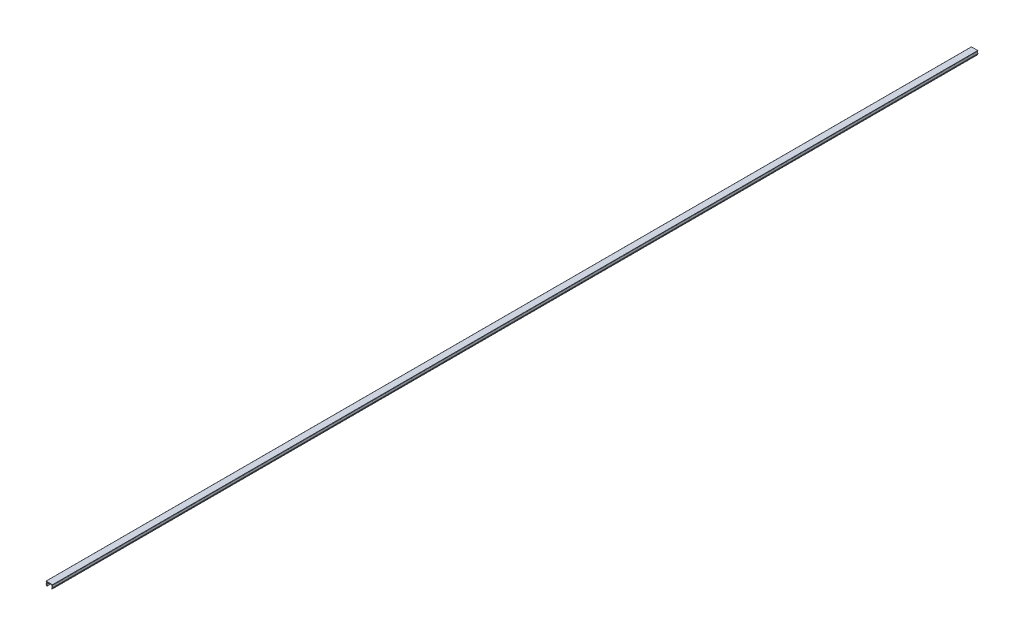
ISO-10303-21;
HEADER;
FILE_DESCRIPTION(('STEP AP214'),'2;1');
FILE_NAME('part.step','',(''),(''),'','','');
FILE_SCHEMA(('AUTOMOTIVE_DESIGN { 1 0 10303 214 1 1 1 1 }'));
ENDSEC;
DATA;
#1=APPLICATION_CONTEXT('core data for automotive mechanical design processes');
#2=APPLICATION_PROTOCOL_DEFINITION('international standard','automotive_design',2000,#1);
#3=PRODUCT_CONTEXT('',#1,'mechanical');
#4=PRODUCT('Part','Part','',(#3));
#5=PRODUCT_RELATED_PRODUCT_CATEGORY('part','',(#4));
#6=PRODUCT_DEFINITION_FORMATION('','',#4);
#7=PRODUCT_DEFINITION_CONTEXT('part definition',#1,'design');
#8=PRODUCT_DEFINITION('design','',#6,#7);
#9=PRODUCT_DEFINITION_SHAPE('','',#8);
#10=(LENGTH_UNIT() NAMED_UNIT(*) SI_UNIT(.MILLI.,.METRE.));
#11=(NAMED_UNIT(*) PLANE_ANGLE_UNIT() SI_UNIT($,.RADIAN.));
#12=(NAMED_UNIT(*) SI_UNIT($,.STERADIAN.) SOLID_ANGLE_UNIT());
#13=UNCERTAINTY_MEASURE_WITH_UNIT(LENGTH_MEASURE(1.E-05),#10,'distance_accuracy_value','');
#14=(GEOMETRIC_REPRESENTATION_CONTEXT(3) GLOBAL_UNCERTAINTY_ASSIGNED_CONTEXT((#13)) GLOBAL_UNIT_ASSIGNED_CONTEXT((#10,
#11,#12)) REPRESENTATION_CONTEXT('',''));
#15=CARTESIAN_POINT('',(0.,0.,0.));
#16=DIRECTION('',(0.,0.,1.));
#17=DIRECTION('',(1.,0.,0.));
#18=AXIS2_PLACEMENT_3D('',#15,#16,#17);
#19=CARTESIAN_POINT('',(3.7477937494903,87.1633342061206,1000.));
#20=DIRECTION('',(0.,0.,-1.));
#21=DIRECTION('',(-1.,0.,0.));
#22=AXIS2_PLACEMENT_3D('',#19,#20,#21);
#23=CYLINDRICAL_SURFACE('',#22,0.5);
#24=CARTESIAN_POINT('',(3.7477937494903,87.1633342061206,0.));
#25=DIRECTION('',(0.,0.,1.));
#26=DIRECTION('',(1.,0.,0.));
#27=AXIS2_PLACEMENT_3D('',#24,#25,#26);
#28=CIRCLE('',#27,0.5);
#29=CARTESIAN_POINT('',(3.25538987298423,87.2501582949543,0.));
#30=VERTEX_POINT('',#29);
#31=CARTESIAN_POINT('',(3.27794743909727,86.992324134458,0.));
#32=VERTEX_POINT('',#31);
#33=EDGE_CURVE('E223',#30,#32,#28,.T.);
#34=ORIENTED_EDGE('',*,*,#33,.T.);
#35=DIRECTION('',(0.,0.,-1.));
#36=VECTOR('',#35,1.);
#37=CARTESIAN_POINT('',(3.27794743909727,86.992324134458,1000.));
#38=LINE('',#37,#36);
#39=CARTESIAN_POINT('',(3.27794743909727,86.992324134458,1000.));
#40=VERTEX_POINT('',#39);
#41=EDGE_CURVE('E11',#40,#32,#38,.T.);
#42=ORIENTED_EDGE('',*,*,#41,.F.);
#43=CARTESIAN_POINT('',(3.7477937494903,87.1633342061206,1000.));
#44=DIRECTION('',(0.,0.,1.));
#45=DIRECTION('',(1.,0.,0.));
#46=AXIS2_PLACEMENT_3D('',#43,#44,#45);
#47=CIRCLE('',#46,0.5);
#48=CARTESIAN_POINT('',(3.25538987298423,87.2501582949543,1000.));
#49=VERTEX_POINT('',#48);
#50=EDGE_CURVE('E269',#49,#40,#47,.T.);
#51=ORIENTED_EDGE('',*,*,#50,.F.);
#52=DIRECTION('',(0.,0.,-1.));
#53=VECTOR('',#52,1.);
#54=CARTESIAN_POINT('',(3.25538987298423,87.2501582949543,1000.));
#55=LINE('',#54,#53);
#56=EDGE_CURVE('E219',#49,#30,#55,.T.);
#57=ORIENTED_EDGE('',*,*,#56,.T.);
#58=EDGE_LOOP('',(#34,#42,#51,#57));
#59=FACE_BOUND('',#58,.T.);
#60=ADVANCED_FACE('F31',(#59),#23,.T.);
#61=CARTESIAN_POINT('',(3.71984554241389,85.7782190738955,1000.));
#62=DIRECTION('',(0.93969262078593,0.342020143325608,0.));
#63=DIRECTION('',(-0.342020143325608,0.93969262078593,0.));
#64=AXIS2_PLACEMENT_3D('',#61,#62,#63);
#65=PLANE('',#64);
#66=DIRECTION('',(0.342020143325608,-0.93969262078593,0.));
#67=VECTOR('',#66,1.);
#68=CARTESIAN_POINT('',(3.71984554241389,85.7782190738955,0.));
#69=LINE('',#68,#67);
#70=CARTESIAN_POINT('',(3.71984554241474,85.7782190738958,0.));
#71=VERTEX_POINT('',#70);
#72=EDGE_CURVE('E226',#32,#71,#69,.T.);
#73=ORIENTED_EDGE('',*,*,#72,.T.);
#74=DIRECTION('',(0.,0.,-1.));
#75=VECTOR('',#74,1.);
#76=CARTESIAN_POINT('',(3.71984554241474,85.7782190738958,1000.));
#77=LINE('',#76,#75);
#78=CARTESIAN_POINT('',(3.71984554241474,85.7782190738958,1000.));
#79=VERTEX_POINT('',#78);
#80=EDGE_CURVE('E39',#79,#71,#77,.T.);
#81=ORIENTED_EDGE('',*,*,#80,.F.);
#82=DIRECTION('',(0.342020143325608,-0.93969262078593,0.));
#83=VECTOR('',#82,1.);
#84=CARTESIAN_POINT('',(3.71984554241389,85.7782190738955,1000.));
#85=LINE('',#84,#83);
#86=EDGE_CURVE('E138',#40,#79,#85,.T.);
#87=ORIENTED_EDGE('',*,*,#86,.F.);
#88=ORIENTED_EDGE('',*,*,#41,.T.);
#89=EDGE_LOOP('',(#73,#81,#87,#88));
#90=FACE_BOUND('',#89,.T.);
#91=ADVANCED_FACE('F407',(#90),#65,.F.);
#92=CARTESIAN_POINT('',(3.94400660807878,85.8598070294793,1000.));
#93=DIRECTION('',(0.,0.,-1.));
#94=DIRECTION('',(-1.,0.,0.));
#95=AXIS2_PLACEMENT_3D('',#92,#93,#94);
#96=CYLINDRICAL_SURFACE('',#95,0.238547223534299);
#97=CARTESIAN_POINT('',(3.94400660807878,85.8598070294793,0.));
#98=DIRECTION('',(0.,0.,1.));
#99=DIRECTION('',(1.,0.,0.));
#100=AXIS2_PLACEMENT_3D('',#97,#98,#99);
#101=CIRCLE('',#100,0.238547223534299);
#102=CARTESIAN_POINT('',(4.16816767374212,85.941394985062,0.));
#103=VERTEX_POINT('',#102);
#104=EDGE_CURVE('E228',#71,#103,#101,.T.);
#105=ORIENTED_EDGE('',*,*,#104,.T.);
#106=DIRECTION('',(0.,0.,-1.));
#107=VECTOR('',#106,1.);
#108=CARTESIAN_POINT('',(4.16816767374212,85.941394985062,1000.));
#109=LINE('',#108,#107);
#110=CARTESIAN_POINT('',(4.16816767374212,85.941394985062,1000.));
#111=VERTEX_POINT('',#110);
#112=EDGE_CURVE('E324',#111,#103,#109,.T.);
#113=ORIENTED_EDGE('',*,*,#112,.F.);
#114=CARTESIAN_POINT('',(3.94400660807878,85.8598070294793,1000.));
#115=DIRECTION('',(0.,0.,1.));
#116=DIRECTION('',(1.,0.,0.));
#117=AXIS2_PLACEMENT_3D('',#114,#115,#116);
#118=CIRCLE('',#117,0.238547223534299);
#119=EDGE_CURVE('E332',#79,#111,#118,.T.);
#120=ORIENTED_EDGE('',*,*,#119,.F.);
#121=ORIENTED_EDGE('',*,*,#80,.T.);
#122=EDGE_LOOP('',(#105,#113,#120,#121));
#123=FACE_BOUND('',#122,.T.);
#124=ADVANCED_FACE('F330',(#123),#96,.T.);
#125=CARTESIAN_POINT('',(3.74900313655878,87.0930400860075,1000.));
#126=DIRECTION('',(-0.939692620785726,-0.342020143326169,0.));
#127=DIRECTION('',(0.342020143326169,-0.939692620785726,0.));
#128=AXIS2_PLACEMENT_3D('',#125,#126,#127);
#129=PLANE('',#128);
#130=DIRECTION('',(-0.342020143326169,0.939692620785726,0.));
#131=VECTOR('',#130,1.);
#132=CARTESIAN_POINT('',(3.74900313655878,87.0930400860075,0.));
#133=LINE('',#132,#131);
#134=CARTESIAN_POINT('',(3.74900313655878,87.0930400860075,0.));
#135=VERTEX_POINT('',#134);
#136=EDGE_CURVE('E230',#103,#135,#133,.T.);
#137=ORIENTED_EDGE('',*,*,#136,.T.);
#138=DIRECTION('',(0.,0.,-1.));
#139=VECTOR('',#138,1.);
#140=CARTESIAN_POINT('',(3.74900313655878,87.0930400860075,1000.));
#141=LINE('',#140,#139);
#142=CARTESIAN_POINT('',(3.74900313655878,87.0930400860075,1000.));
#143=VERTEX_POINT('',#142);
#144=EDGE_CURVE('E321',#143,#135,#141,.T.);
#145=ORIENTED_EDGE('',*,*,#144,.F.);
#146=DIRECTION('',(-0.342020143326169,0.939692620785726,0.));
#147=VECTOR('',#146,1.);
#148=CARTESIAN_POINT('',(3.74900313655878,87.0930400860075,1000.));
#149=LINE('',#148,#147);
#150=EDGE_CURVE('E350',#111,#143,#149,.T.);
#151=ORIENTED_EDGE('',*,*,#150,.F.);
#152=ORIENTED_EDGE('',*,*,#112,.T.);
#153=EDGE_LOOP('',(#137,#145,#151,#152));
#154=FACE_BOUND('',#153,.T.);
#155=ADVANCED_FACE('F341',(#154),#129,.F.);
#156=CARTESIAN_POINT('',(3.84297239863858,87.1272421003405,1000.));
#157=DIRECTION('',(0.,0.,-1.));
#158=DIRECTION('',(-1.,0.,0.));
#159=AXIS2_PLACEMENT_3D('',#156,#157,#158);
#160=CYLINDRICAL_SURFACE('',#159,0.100000000001303);
#161=CARTESIAN_POINT('',(3.84297239863858,87.1272421003405,0.));
#162=DIRECTION('',(0.,0.,-1.));
#163=DIRECTION('',(1.,0.,0.));
#164=AXIS2_PLACEMENT_3D('',#161,#162,#163);
#165=CIRCLE('',#164,0.100000000001303);
#166=CARTESIAN_POINT('',(3.74449162333608,87.1446069181075,0.));
#167=VERTEX_POINT('',#166);
#168=EDGE_CURVE('E232',#135,#167,#165,.T.);
#169=ORIENTED_EDGE('',*,*,#168,.T.);
#170=DIRECTION('',(0.,0.,-1.));
#171=VECTOR('',#170,1.);
#172=CARTESIAN_POINT('',(3.74449162333608,87.1446069181075,1000.));
#173=LINE('',#172,#171);
#174=CARTESIAN_POINT('',(3.74449162333608,87.1446069181075,1000.));
#175=VERTEX_POINT('',#174);
#176=EDGE_CURVE('E318',#175,#167,#173,.T.);
#177=ORIENTED_EDGE('',*,*,#176,.F.);
#178=CARTESIAN_POINT('',(3.84297239863858,87.1272421003405,1000.));
#179=DIRECTION('',(0.,0.,-1.));
#180=DIRECTION('',(1.,0.,0.));
#181=AXIS2_PLACEMENT_3D('',#178,#179,#180);
#182=CIRCLE('',#181,0.100000000001303);
#183=EDGE_CURVE('E347',#143,#175,#182,.T.);
#184=ORIENTED_EDGE('',*,*,#183,.F.);
#185=ORIENTED_EDGE('',*,*,#144,.T.);
#186=EDGE_LOOP('',(#169,#177,#184,#185));
#187=FACE_BOUND('',#186,.T.);
#188=ADVANCED_FACE('F345',(#187),#160,.F.);
#189=CARTESIAN_POINT('',(4.18065618621034,89.6182190738957,1000.));
#190=DIRECTION('',(-0.984807753012184,0.173648177667068,0.));
#191=DIRECTION('',(-0.173648177667068,-0.984807753012184,0.));
#192=AXIS2_PLACEMENT_3D('',#189,#190,#191);
#193=PLANE('',#192);
#194=DIRECTION('',(0.173648177667068,0.984807753012184,0.));
#195=VECTOR('',#194,1.);
#196=CARTESIAN_POINT('',(4.18065618621034,89.6182190738957,0.));
#197=LINE('',#196,#195);
#198=CARTESIAN_POINT('',(4.18065618621034,89.6182190738957,0.));
#199=VERTEX_POINT('',#198);
#200=EDGE_CURVE('E234',#167,#199,#197,.T.);
#201=ORIENTED_EDGE('',*,*,#200,.T.);
#202=DIRECTION('',(0.,0.,-1.));
#203=VECTOR('',#202,1.);
#204=CARTESIAN_POINT('',(4.18065618621034,89.6182190738957,1000.));
#205=LINE('',#204,#203);
#206=CARTESIAN_POINT('',(4.18065618621034,89.6182190738957,1000.));
#207=VERTEX_POINT('',#206);
#208=EDGE_CURVE('E315',#207,#199,#205,.T.);
#209=ORIENTED_EDGE('',*,*,#208,.F.);
#210=DIRECTION('',(0.173648177667068,0.984807753012184,0.));
#211=VECTOR('',#210,1.);
#212=CARTESIAN_POINT('',(4.18065618621034,89.6182190738957,1000.));
#213=LINE('',#212,#211);
#214=EDGE_CURVE('E349',#175,#207,#213,.T.);
#215=ORIENTED_EDGE('',*,*,#214,.F.);
#216=ORIENTED_EDGE('',*,*,#176,.T.);
#217=EDGE_LOOP('',(#201,#209,#215,#216));
#218=FACE_BOUND('',#217,.T.);
#219=ADVANCED_FACE('F420',(#218),#193,.F.);
#220=CARTESIAN_POINT('',(9.16522957432238,89.6182190738957,1000.));
#221=DIRECTION('',(0.,1.,0.));
#222=DIRECTION('',(0.,0.,1.));
#223=AXIS2_PLACEMENT_3D('',#220,#221,#222);
#224=PLANE('',#223);
#225=DIRECTION('',(1.,0.,0.));
#226=VECTOR('',#225,1.);
#227=CARTESIAN_POINT('',(9.16522957432238,89.6182190738957,0.));
#228=LINE('',#227,#226);
#229=CARTESIAN_POINT('',(9.16522957432238,89.6182190738957,0.));
#230=VERTEX_POINT('',#229);
#231=EDGE_CURVE('E236',#199,#230,#228,.T.);
#232=ORIENTED_EDGE('',*,*,#231,.T.);
#233=DIRECTION('',(0.,0.,-1.));
#234=VECTOR('',#233,1.);
#235=CARTESIAN_POINT('',(9.16522957432238,89.6182190738957,1000.));
#236=LINE('',#235,#234);
#237=CARTESIAN_POINT('',(9.16522957432238,89.6182190738957,1000.));
#238=VERTEX_POINT('',#237);
#239=EDGE_CURVE('E312',#238,#230,#236,.T.);
#240=ORIENTED_EDGE('',*,*,#239,.F.);
#241=DIRECTION('',(1.,0.,0.));
#242=VECTOR('',#241,1.);
#243=CARTESIAN_POINT('',(9.16522957432238,89.6182190738957,1000.));
#244=LINE('',#243,#242);
#245=EDGE_CURVE('E352',#207,#238,#244,.T.);
#246=ORIENTED_EDGE('',*,*,#245,.F.);
#247=ORIENTED_EDGE('',*,*,#208,.T.);
#248=EDGE_LOOP('',(#232,#240,#246,#247));
#249=FACE_BOUND('',#248,.T.);
#250=ADVANCED_FACE('F423',(#249),#224,.F.);
#251=CARTESIAN_POINT('',(9.60139413719656,87.1446069181068,1000.));
#252=DIRECTION('',(0.984807753012197,0.173648177666994,0.));
#253=DIRECTION('',(-0.173648177666994,0.984807753012197,0.));
#254=AXIS2_PLACEMENT_3D('',#251,#252,#253);
#255=PLANE('',#254);
#256=DIRECTION('',(0.173648177666994,-0.984807753012197,0.));
#257=VECTOR('',#256,1.);
#258=CARTESIAN_POINT('',(9.60139413719656,87.1446069181068,0.));
#259=LINE('',#258,#257);
#260=CARTESIAN_POINT('',(9.60139413719656,87.1446069181068,0.));
#261=VERTEX_POINT('',#260);
#262=EDGE_CURVE('E238',#230,#261,#259,.T.);
#263=ORIENTED_EDGE('',*,*,#262,.T.);
#264=DIRECTION('',(0.,0.,-1.));
#265=VECTOR('',#264,1.);
#266=CARTESIAN_POINT('',(9.60139413719656,87.1446069181068,1000.));
#267=LINE('',#266,#265);
#268=CARTESIAN_POINT('',(9.60139413719656,87.1446069181068,1000.));
#269=VERTEX_POINT('',#268);
#270=EDGE_CURVE('E309',#269,#261,#267,.T.);
#271=ORIENTED_EDGE('',*,*,#270,.F.);
#272=DIRECTION('',(0.173648177666994,-0.984807753012197,0.));
#273=VECTOR('',#272,1.);
#274=CARTESIAN_POINT('',(9.60139413719656,87.1446069181068,1000.));
#275=LINE('',#274,#273);
#276=EDGE_CURVE('E358',#238,#269,#275,.T.);
#277=ORIENTED_EDGE('',*,*,#276,.F.);
#278=ORIENTED_EDGE('',*,*,#239,.T.);
#279=EDGE_LOOP('',(#263,#271,#277,#278));
#280=FACE_BOUND('',#279,.T.);
#281=ADVANCED_FACE('F427',(#280),#255,.F.);
#282=CARTESIAN_POINT('',(9.50291336189533,87.1272421003407,1000.));
#283=DIRECTION('',(0.,0.,-1.));
#284=DIRECTION('',(-1.,0.,0.));
#285=AXIS2_PLACEMENT_3D('',#282,#283,#284);
#286=CYLINDRICAL_SURFACE('',#285,0.0999999999999064);
#287=CARTESIAN_POINT('',(9.50291336189533,87.1272421003407,0.));
#288=DIRECTION('',(0.,0.,-1.));
#289=DIRECTION('',(1.,0.,0.));
#290=AXIS2_PLACEMENT_3D('',#287,#288,#289);
#291=CIRCLE('',#290,0.0999999999999064);
#292=CARTESIAN_POINT('',(9.59688262397385,87.0930400860082,0.));
#293=VERTEX_POINT('',#292);
#294=EDGE_CURVE('E240',#261,#293,#291,.T.);
#295=ORIENTED_EDGE('',*,*,#294,.T.);
#296=DIRECTION('',(0.,0.,-1.));
#297=VECTOR('',#296,1.);
#298=CARTESIAN_POINT('',(9.59688262397385,87.0930400860082,1000.));
#299=LINE('',#298,#297);
#300=CARTESIAN_POINT('',(9.59688262397385,87.0930400860082,1000.));
#301=VERTEX_POINT('',#300);
#302=EDGE_CURVE('E306',#301,#293,#299,.T.);
#303=ORIENTED_EDGE('',*,*,#302,.F.);
#304=CARTESIAN_POINT('',(9.50291336189533,87.1272421003407,1000.));
#305=DIRECTION('',(0.,0.,-1.));
#306=DIRECTION('',(1.,0.,0.));
#307=AXIS2_PLACEMENT_3D('',#304,#305,#306);
#308=CIRCLE('',#307,0.0999999999999064);
#309=EDGE_CURVE('E360',#269,#301,#308,.T.);
#310=ORIENTED_EDGE('',*,*,#309,.F.);
#311=ORIENTED_EDGE('',*,*,#270,.T.);
#312=EDGE_LOOP('',(#295,#303,#310,#311));
#313=FACE_BOUND('',#312,.T.);
#314=ADVANCED_FACE('F431',(#313),#286,.F.);
#315=CARTESIAN_POINT('',(9.1777180867905,85.9413949850629,1000.));
#316=DIRECTION('',(0.939692620785708,-0.342020143326218,0.));
#317=DIRECTION('',(0.342020143326218,0.939692620785708,0.));
#318=AXIS2_PLACEMENT_3D('',#315,#316,#317);
#319=PLANE('',#318);
#320=DIRECTION('',(-0.342020143326218,-0.939692620785708,0.));
#321=VECTOR('',#320,1.);
#322=CARTESIAN_POINT('',(9.1777180867905,85.9413949850629,0.));
#323=LINE('',#322,#321);
#324=CARTESIAN_POINT('',(9.1777180867905,85.9413949850629,0.));
#325=VERTEX_POINT('',#324);
#326=EDGE_CURVE('E242',#293,#325,#323,.T.);
#327=ORIENTED_EDGE('',*,*,#326,.T.);
#328=DIRECTION('',(0.,0.,-1.));
#329=VECTOR('',#328,1.);
#330=CARTESIAN_POINT('',(9.1777180867905,85.9413949850629,1000.));
#331=LINE('',#330,#329);
#332=CARTESIAN_POINT('',(9.1777180867905,85.9413949850629,1000.));
#333=VERTEX_POINT('',#332);
#334=EDGE_CURVE('E303',#333,#325,#331,.T.);
#335=ORIENTED_EDGE('',*,*,#334,.F.);
#336=DIRECTION('',(-0.342020143326218,-0.939692620785708,0.));
#337=VECTOR('',#336,1.);
#338=CARTESIAN_POINT('',(9.1777180867905,85.9413949850629,1000.));
#339=LINE('',#338,#337);
#340=EDGE_CURVE('E362',#301,#333,#339,.T.);
#341=ORIENTED_EDGE('',*,*,#340,.F.);
#342=ORIENTED_EDGE('',*,*,#302,.T.);
#343=EDGE_LOOP('',(#327,#335,#341,#342));
#344=FACE_BOUND('',#343,.T.);
#345=ADVANCED_FACE('F435',(#344),#319,.F.);
#346=CARTESIAN_POINT('',(9.4018791524562,85.8598070294791,1000.));
#347=DIRECTION('',(0.,0.,-1.));
#348=DIRECTION('',(-1.,0.,0.));
#349=AXIS2_PLACEMENT_3D('',#346,#347,#348);
#350=CYLINDRICAL_SURFACE('',#349,0.238547223536003);
#351=CARTESIAN_POINT('',(9.4018791524562,85.8598070294791,0.));
#352=DIRECTION('',(0.,0.,1.));
#353=DIRECTION('',(1.,0.,0.));
#354=AXIS2_PLACEMENT_3D('',#351,#352,#353);
#355=CIRCLE('',#354,0.238547223536003);
#356=CARTESIAN_POINT('',(9.62604021812199,85.7782190738955,0.));
#357=VERTEX_POINT('',#356);
#358=EDGE_CURVE('E244',#325,#357,#355,.T.);
#359=ORIENTED_EDGE('',*,*,#358,.T.);
#360=DIRECTION('',(0.,0.,-1.));
#361=VECTOR('',#360,1.);
#362=CARTESIAN_POINT('',(9.62604021812199,85.7782190738955,1000.));
#363=LINE('',#362,#361);
#364=CARTESIAN_POINT('',(9.62604021812199,85.7782190738955,1000.));
#365=VERTEX_POINT('',#364);
#366=EDGE_CURVE('E300',#365,#357,#363,.T.);
#367=ORIENTED_EDGE('',*,*,#366,.F.);
#368=CARTESIAN_POINT('',(9.4018791524562,85.8598070294791,1000.));
#369=DIRECTION('',(0.,0.,1.));
#370=DIRECTION('',(1.,0.,0.));
#371=AXIS2_PLACEMENT_3D('',#368,#369,#370);
#372=CIRCLE('',#371,0.238547223536003);
#373=EDGE_CURVE('E364',#333,#365,#372,.T.);
#374=ORIENTED_EDGE('',*,*,#373,.F.);
#375=ORIENTED_EDGE('',*,*,#334,.T.);
#376=EDGE_LOOP('',(#359,#367,#374,#375));
#377=FACE_BOUND('',#376,.T.);
#378=ADVANCED_FACE('F439',(#377),#350,.T.);
#379=CARTESIAN_POINT('',(10.0679383214372,86.992324134458,1000.));
#380=DIRECTION('',(-0.939692620786294,0.342020143324609,0.));
#381=DIRECTION('',(-0.342020143324609,-0.939692620786294,0.));
#382=AXIS2_PLACEMENT_3D('',#379,#380,#381);
#383=PLANE('',#382);
#384=DIRECTION('',(0.342020143324609,0.939692620786294,0.));
#385=VECTOR('',#384,1.);
#386=CARTESIAN_POINT('',(10.0679383214372,86.992324134458,0.));
#387=LINE('',#386,#385);
#388=CARTESIAN_POINT('',(10.0679383214372,86.992324134458,0.));
#389=VERTEX_POINT('',#388);
#390=EDGE_CURVE('E246',#357,#389,#387,.T.);
#391=ORIENTED_EDGE('',*,*,#390,.T.);
#392=DIRECTION('',(0.,0.,-1.));
#393=VECTOR('',#392,1.);
#394=CARTESIAN_POINT('',(10.0679383214372,86.992324134458,1000.));
#395=LINE('',#394,#393);
#396=CARTESIAN_POINT('',(10.0679383214372,86.992324134458,1000.));
#397=VERTEX_POINT('',#396);
#398=EDGE_CURVE('E297',#397,#389,#395,.T.);
#399=ORIENTED_EDGE('',*,*,#398,.F.);
#400=DIRECTION('',(0.342020143324609,0.939692620786294,0.));
#401=VECTOR('',#400,1.);
#402=CARTESIAN_POINT('',(10.0679383214372,86.992324134458,1000.));
#403=LINE('',#402,#401);
#404=EDGE_CURVE('E366',#365,#397,#403,.T.);
#405=ORIENTED_EDGE('',*,*,#404,.F.);
#406=ORIENTED_EDGE('',*,*,#366,.T.);
#407=EDGE_LOOP('',(#391,#399,#405,#406));
#408=FACE_BOUND('',#407,.T.);
#409=ADVANCED_FACE('F443',(#408),#383,.F.);
#410=CARTESIAN_POINT('',(9.59809201104454,87.1633342061208,1000.));
#411=DIRECTION('',(0.,0.,-1.));
#412=DIRECTION('',(-1.,0.,0.));
#413=AXIS2_PLACEMENT_3D('',#410,#411,#412);
#414=CYLINDRICAL_SURFACE('',#413,0.499999999999682);
#415=CARTESIAN_POINT('',(9.59809201104454,87.1633342061208,0.));
#416=DIRECTION('',(0.,0.,1.));
#417=DIRECTION('',(1.,0.,0.));
#418=AXIS2_PLACEMENT_3D('',#415,#416,#417);
#419=CIRCLE('',#418,0.499999999999682);
#420=CARTESIAN_POINT('',(10.0904958875503,87.2501582949544,0.));
#421=VERTEX_POINT('',#420);
#422=EDGE_CURVE('E248',#389,#421,#419,.T.);
#423=ORIENTED_EDGE('',*,*,#422,.T.);
#424=DIRECTION('',(0.,0.,-1.));
#425=VECTOR('',#424,1.);
#426=CARTESIAN_POINT('',(10.0904958875503,87.2501582949544,1000.));
#427=LINE('',#426,#425);
#428=CARTESIAN_POINT('',(10.0904958875503,87.2501582949544,1000.));
#429=VERTEX_POINT('',#428);
#430=EDGE_CURVE('E294',#429,#421,#427,.T.);
#431=ORIENTED_EDGE('',*,*,#430,.F.);
#432=CARTESIAN_POINT('',(9.59809201104454,87.1633342061208,1000.));
#433=DIRECTION('',(0.,0.,1.));
#434=DIRECTION('',(1.,0.,0.));
#435=AXIS2_PLACEMENT_3D('',#432,#433,#434);
#436=CIRCLE('',#435,0.499999999999682);
#437=EDGE_CURVE('E368',#397,#429,#436,.T.);
#438=ORIENTED_EDGE('',*,*,#437,.F.);
#439=ORIENTED_EDGE('',*,*,#398,.T.);
#440=EDGE_LOOP('',(#423,#431,#438,#439));
#441=FACE_BOUND('',#440,.T.);
#442=ADVANCED_FACE('F447',(#441),#414,.T.);
#443=CARTESIAN_POINT('',(9.67294288026739,89.6182190738958,1000.));
#444=DIRECTION('',(-0.984807753012347,-0.173648177666142,0.));
#445=DIRECTION('',(0.173648177666142,-0.984807753012347,0.));
#446=AXIS2_PLACEMENT_3D('',#443,#444,#445);
#447=PLANE('',#446);
#448=DIRECTION('',(-0.173648177666142,0.984807753012347,0.));
#449=VECTOR('',#448,1.);
#450=CARTESIAN_POINT('',(9.67294288026739,89.6182190738958,0.));
#451=LINE('',#450,#449);
#452=CARTESIAN_POINT('',(9.67294288026739,89.6182190738958,0.));
#453=VERTEX_POINT('',#452);
#454=EDGE_CURVE('E250',#421,#453,#451,.T.);
#455=ORIENTED_EDGE('',*,*,#454,.T.);
#456=DIRECTION('',(0.,0.,-1.));
#457=VECTOR('',#456,1.);
#458=CARTESIAN_POINT('',(9.67294288026739,89.6182190738958,1000.));
#459=LINE('',#458,#457);
#460=CARTESIAN_POINT('',(9.67294288026739,89.6182190738958,1000.));
#461=VERTEX_POINT('',#460);
#462=EDGE_CURVE('E291',#461,#453,#459,.T.);
#463=ORIENTED_EDGE('',*,*,#462,.F.);
#464=DIRECTION('',(-0.173648177666142,0.984807753012347,0.));
#465=VECTOR('',#464,1.);
#466=CARTESIAN_POINT('',(9.67294288026739,89.6182190738958,1000.));
#467=LINE('',#466,#465);
#468=EDGE_CURVE('E370',#429,#461,#467,.T.);
#469=ORIENTED_EDGE('',*,*,#468,.F.);
#470=ORIENTED_EDGE('',*,*,#430,.T.);
#471=EDGE_LOOP('',(#455,#463,#469,#470));
#472=FACE_BOUND('',#471,.T.);
#473=ADVANCED_FACE('F451',(#472),#447,.F.);
#474=CARTESIAN_POINT('',(10.1729428802699,89.6182190738958,1000.));
#475=DIRECTION('',(0.,1.,0.));
#476=DIRECTION('',(0.,0.,1.));
#477=AXIS2_PLACEMENT_3D('',#474,#475,#476);
#478=PLANE('',#477);
#479=DIRECTION('',(1.,0.,0.));
#480=VECTOR('',#479,1.);
#481=CARTESIAN_POINT('',(10.1729428802699,89.6182190738958,0.));
#482=LINE('',#481,#480);
#483=CARTESIAN_POINT('',(10.1729428802699,89.6182190738958,0.));
#484=VERTEX_POINT('',#483);
#485=EDGE_CURVE('E252',#453,#484,#482,.T.);
#486=ORIENTED_EDGE('',*,*,#485,.T.);
#487=DIRECTION('',(0.,0.,-1.));
#488=VECTOR('',#487,1.);
#489=CARTESIAN_POINT('',(10.1729428802699,89.6182190738958,1000.));
#490=LINE('',#489,#488);
#491=CARTESIAN_POINT('',(10.1729428802699,89.6182190738958,1000.));
#492=VERTEX_POINT('',#491);
#493=EDGE_CURVE('E288',#492,#484,#490,.T.);
#494=ORIENTED_EDGE('',*,*,#493,.F.);
#495=DIRECTION('',(1.,0.,0.));
#496=VECTOR('',#495,1.);
#497=CARTESIAN_POINT('',(10.1729428802699,89.6182190738958,1000.));
#498=LINE('',#497,#496);
#499=EDGE_CURVE('E372',#461,#492,#498,.T.);
#500=ORIENTED_EDGE('',*,*,#499,.F.);
#501=ORIENTED_EDGE('',*,*,#462,.T.);
#502=EDGE_LOOP('',(#486,#494,#500,#501));
#503=FACE_BOUND('',#502,.T.);
#504=ADVANCED_FACE('F455',(#503),#478,.F.);
#505=CARTESIAN_POINT('',(10.1729428802699,89.718219073896,1000.));
#506=DIRECTION('',(0.,0.,-1.));
#507=DIRECTION('',(-1.,0.,0.));
#508=AXIS2_PLACEMENT_3D('',#505,#506,#507);
#509=CYLINDRICAL_SURFACE('',#508,0.100000000000186);
#510=CARTESIAN_POINT('',(10.1729428802699,89.718219073896,0.));
#511=DIRECTION('',(0.,0.,1.));
#512=DIRECTION('',(1.,0.,0.));
#513=AXIS2_PLACEMENT_3D('',#510,#511,#512);
#514=CIRCLE('',#513,0.100000000000186);
#515=CARTESIAN_POINT('',(10.2729428802701,89.7182190738968,0.));
#516=VERTEX_POINT('',#515);
#517=EDGE_CURVE('E254',#484,#516,#514,.T.);
#518=ORIENTED_EDGE('',*,*,#517,.T.);
#519=DIRECTION('',(0.,0.,-1.));
#520=VECTOR('',#519,1.);
#521=CARTESIAN_POINT('',(10.2729428802701,89.7182190738968,1000.));
#522=LINE('',#521,#520);
#523=CARTESIAN_POINT('',(10.2729428802701,89.7182190738968,1000.));
#524=VERTEX_POINT('',#523);
#525=EDGE_CURVE('E285',#524,#516,#522,.T.);
#526=ORIENTED_EDGE('',*,*,#525,.F.);
#527=CARTESIAN_POINT('',(10.1729428802699,89.718219073896,1000.));
#528=DIRECTION('',(0.,0.,1.));
#529=DIRECTION('',(1.,0.,0.));
#530=AXIS2_PLACEMENT_3D('',#527,#528,#529);
#531=CIRCLE('',#530,0.100000000000186);
#532=EDGE_CURVE('E374',#492,#524,#531,.T.);
#533=ORIENTED_EDGE('',*,*,#532,.F.);
#534=ORIENTED_EDGE('',*,*,#493,.T.);
#535=EDGE_LOOP('',(#518,#526,#533,#534));
#536=FACE_BOUND('',#535,.T.);
#537=ADVANCED_FACE('F459',(#536),#509,.T.);
#538=CARTESIAN_POINT('',(10.2729428802704,89.9182190738957,1000.));
#539=DIRECTION('',(-1.,1.81278603240565E-12,0.));
#540=DIRECTION('',(-1.81278603240565E-12,-1.,0.));
#541=AXIS2_PLACEMENT_3D('',#538,#539,#540);
#542=PLANE('',#541);
#543=DIRECTION('',(1.81278603240565E-12,1.,0.));
#544=VECTOR('',#543,1.);
#545=CARTESIAN_POINT('',(10.2729428802704,89.9182190738957,0.));
#546=LINE('',#545,#544);
#547=CARTESIAN_POINT('',(10.2729428802701,89.9182190738957,0.));
#548=VERTEX_POINT('',#547);
#549=EDGE_CURVE('E256',#516,#548,#546,.T.);
#550=ORIENTED_EDGE('',*,*,#549,.T.);
#551=DIRECTION('',(0.,0.,-1.));
#552=VECTOR('',#551,1.);
#553=CARTESIAN_POINT('',(10.2729428802701,89.9182190738957,1000.));
#554=LINE('',#553,#552);
#555=CARTESIAN_POINT('',(10.2729428802701,89.9182190738957,1000.));
#556=VERTEX_POINT('',#555);
#557=EDGE_CURVE('E282',#556,#548,#554,.T.);
#558=ORIENTED_EDGE('',*,*,#557,.F.);
#559=DIRECTION('',(1.81278603240565E-12,1.,0.));
#560=VECTOR('',#559,1.);
#561=CARTESIAN_POINT('',(10.2729428802704,89.9182190738957,1000.));
#562=LINE('',#561,#560);
#563=EDGE_CURVE('E376',#524,#556,#562,.T.);
#564=ORIENTED_EDGE('',*,*,#563,.F.);
#565=ORIENTED_EDGE('',*,*,#525,.T.);
#566=EDGE_LOOP('',(#550,#558,#564,#565));
#567=FACE_BOUND('',#566,.T.);
#568=ADVANCED_FACE('F463',(#567),#542,.F.);
#569=CARTESIAN_POINT('',(10.0729428802697,89.9182190738957,1000.));
#570=DIRECTION('',(0.,0.,-1.));
#571=DIRECTION('',(-1.,0.,0.));
#572=AXIS2_PLACEMENT_3D('',#569,#570,#571);
#573=CYLINDRICAL_SURFACE('',#572,0.200000000000368);
#574=CARTESIAN_POINT('',(10.0729428802697,89.9182190738957,0.));
#575=DIRECTION('',(0.,0.,1.));
#576=DIRECTION('',(1.,0.,0.));
#577=AXIS2_PLACEMENT_3D('',#574,#575,#576);
#578=CIRCLE('',#577,0.200000000000368);
#579=CARTESIAN_POINT('',(10.0729428802697,90.1182190738957,0.));
#580=VERTEX_POINT('',#579);
#581=EDGE_CURVE('E258',#548,#580,#578,.T.);
#582=ORIENTED_EDGE('',*,*,#581,.T.);
#583=DIRECTION('',(0.,0.,-1.));
#584=VECTOR('',#583,1.);
#585=CARTESIAN_POINT('',(10.0729428802697,90.1182190738957,1000.));
#586=LINE('',#585,#584);
#587=CARTESIAN_POINT('',(10.0729428802697,90.1182190738957,1000.));
#588=VERTEX_POINT('',#587);
#589=EDGE_CURVE('E279',#588,#580,#586,.T.);
#590=ORIENTED_EDGE('',*,*,#589,.F.);
#591=CARTESIAN_POINT('',(10.0729428802697,89.9182190738957,1000.));
#592=DIRECTION('',(0.,0.,1.));
#593=DIRECTION('',(1.,0.,0.));
#594=AXIS2_PLACEMENT_3D('',#591,#592,#593);
#595=CIRCLE('',#594,0.200000000000368);
#596=EDGE_CURVE('E378',#556,#588,#595,.T.);
#597=ORIENTED_EDGE('',*,*,#596,.F.);
#598=ORIENTED_EDGE('',*,*,#557,.T.);
#599=EDGE_LOOP('',(#582,#590,#597,#598));
#600=FACE_BOUND('',#599,.T.);
#601=ADVANCED_FACE('F467',(#600),#573,.T.);
#602=CARTESIAN_POINT('',(3.27294288027042,90.1182190738964,1000.));
#603=DIRECTION('',(-1.06124259706828E-13,-1.,0.));
#604=DIRECTION('',(1.,-1.06124259706828E-13,0.));
#605=AXIS2_PLACEMENT_3D('',#602,#603,#604);
#606=PLANE('',#605);
#607=DIRECTION('',(-1.,1.06124259706828E-13,0.));
#608=VECTOR('',#607,1.);
#609=CARTESIAN_POINT('',(3.27294288027042,90.1182190738964,0.));
#610=LINE('',#609,#608);
#611=CARTESIAN_POINT('',(3.27294288027042,90.118219073896,0.));
#612=VERTEX_POINT('',#611);
#613=EDGE_CURVE('E260',#580,#612,#610,.T.);
#614=ORIENTED_EDGE('',*,*,#613,.T.);
#615=DIRECTION('',(0.,0.,-1.));
#616=VECTOR('',#615,1.);
#617=CARTESIAN_POINT('',(3.27294288027042,90.118219073896,1000.));
#618=LINE('',#617,#616);
#619=CARTESIAN_POINT('',(3.27294288027042,90.118219073896,1000.));
#620=VERTEX_POINT('',#619);
#621=EDGE_CURVE('E276',#620,#612,#618,.T.);
#622=ORIENTED_EDGE('',*,*,#621,.F.);
#623=DIRECTION('',(-1.,1.06124259706828E-13,0.));
#624=VECTOR('',#623,1.);
#625=CARTESIAN_POINT('',(3.27294288027042,90.1182190738964,1000.));
#626=LINE('',#625,#624);
#627=EDGE_CURVE('E380',#588,#620,#626,.T.);
#628=ORIENTED_EDGE('',*,*,#627,.F.);
#629=ORIENTED_EDGE('',*,*,#589,.T.);
#630=EDGE_LOOP('',(#614,#622,#628,#629));
#631=FACE_BOUND('',#630,.T.);
#632=ADVANCED_FACE('F471',(#631),#606,.F.);
#633=CARTESIAN_POINT('',(3.27294288027042,89.9182190738957,1000.));
#634=DIRECTION('',(0.,0.,-1.));
#635=DIRECTION('',(-1.,0.,0.));
#636=AXIS2_PLACEMENT_3D('',#633,#634,#635);
#637=CYLINDRICAL_SURFACE('',#636,0.200000000000364);
#638=CARTESIAN_POINT('',(3.27294288027042,89.9182190738957,0.));
#639=DIRECTION('',(0.,0.,1.));
#640=DIRECTION('',(1.,0.,0.));
#641=AXIS2_PLACEMENT_3D('',#638,#639,#640);
#642=CIRCLE('',#641,0.200000000000364);
#643=CARTESIAN_POINT('',(3.07294288027042,89.9182190738957,0.));
#644=VERTEX_POINT('',#643);
#645=EDGE_CURVE('E262',#612,#644,#642,.T.);
#646=ORIENTED_EDGE('',*,*,#645,.T.);
#647=DIRECTION('',(0.,0.,-1.));
#648=VECTOR('',#647,1.);
#649=CARTESIAN_POINT('',(3.07294288027042,89.9182190738957,1000.));
#650=LINE('',#649,#648);
#651=CARTESIAN_POINT('',(3.07294288027042,89.9182190738957,1000.));
#652=VERTEX_POINT('',#651);
#653=EDGE_CURVE('E273',#652,#644,#650,.T.);
#654=ORIENTED_EDGE('',*,*,#653,.F.);
#655=CARTESIAN_POINT('',(3.27294288027042,89.9182190738957,1000.));
#656=DIRECTION('',(0.,0.,1.));
#657=DIRECTION('',(1.,0.,0.));
#658=AXIS2_PLACEMENT_3D('',#655,#656,#657);
#659=CIRCLE('',#658,0.200000000000364);
#660=EDGE_CURVE('E382',#620,#652,#659,.T.);
#661=ORIENTED_EDGE('',*,*,#660,.F.);
#662=ORIENTED_EDGE('',*,*,#621,.T.);
#663=EDGE_LOOP('',(#646,#654,#661,#662));
#664=FACE_BOUND('',#663,.T.);
#665=ADVANCED_FACE('F388',(#664),#637,.T.);
#666=CARTESIAN_POINT('',(3.07294288026969,89.7182190738968,1000.));
#667=DIRECTION('',(1.,-3.63858249088119E-12,0.));
#668=DIRECTION('',(3.63858249088119E-12,1.,0.));
#669=AXIS2_PLACEMENT_3D('',#666,#667,#668);
#670=PLANE('',#669);
#671=DIRECTION('',(-3.63858249088119E-12,-1.,0.));
#672=VECTOR('',#671,1.);
#673=CARTESIAN_POINT('',(3.07294288026969,89.7182190738968,0.));
#674=LINE('',#673,#672);
#675=CARTESIAN_POINT('',(3.07294288026969,89.7182190738968,0.));
#676=VERTEX_POINT('',#675);
#677=EDGE_CURVE('E264',#644,#676,#674,.T.);
#678=ORIENTED_EDGE('',*,*,#677,.T.);
#679=DIRECTION('',(0.,0.,-1.));
#680=VECTOR('',#679,1.);
#681=CARTESIAN_POINT('',(3.07294288026969,89.7182190738968,1000.));
#682=LINE('',#681,#680);
#683=CARTESIAN_POINT('',(3.07294288026969,89.7182190738968,1000.));
#684=VERTEX_POINT('',#683);
#685=EDGE_CURVE('E214',#684,#676,#682,.T.);
#686=ORIENTED_EDGE('',*,*,#685,.F.);
#687=DIRECTION('',(-3.63858249088119E-12,-1.,0.));
#688=VECTOR('',#687,1.);
#689=CARTESIAN_POINT('',(3.07294288026969,89.7182190738968,1000.));
#690=LINE('',#689,#688);
#691=EDGE_CURVE('E205',#652,#684,#690,.T.);
#692=ORIENTED_EDGE('',*,*,#691,.F.);
#693=ORIENTED_EDGE('',*,*,#653,.T.);
#694=EDGE_LOOP('',(#678,#686,#692,#693));
#695=FACE_BOUND('',#694,.T.);
#696=ADVANCED_FACE('F392',(#695),#670,.F.);
#697=CARTESIAN_POINT('',(3.17294288027079,89.7182190738968,1000.));
#698=DIRECTION('',(0.,0.,-1.));
#699=DIRECTION('',(-1.,0.,0.));
#700=AXIS2_PLACEMENT_3D('',#697,#698,#699);
#701=CYLINDRICAL_SURFACE('',#700,0.100000000001096);
#702=CARTESIAN_POINT('',(3.17294288027079,89.7182190738968,0.));
#703=DIRECTION('',(0.,0.,1.));
#704=DIRECTION('',(1.,0.,0.));
#705=AXIS2_PLACEMENT_3D('',#702,#703,#704);
#706=CIRCLE('',#705,0.100000000001096);
#707=CARTESIAN_POINT('',(3.17294288027079,89.6182190738957,0.));
#708=VERTEX_POINT('',#707);
#709=EDGE_CURVE('E213',#676,#708,#706,.T.);
#710=ORIENTED_EDGE('',*,*,#709,.T.);
#711=DIRECTION('',(0.,0.,-1.));
#712=VECTOR('',#711,1.);
#713=CARTESIAN_POINT('',(3.17294288027079,89.6182190738957,1000.));
#714=LINE('',#713,#712);
#715=CARTESIAN_POINT('',(3.17294288027079,89.6182190738957,1000.));
#716=VERTEX_POINT('',#715);
#717=EDGE_CURVE('E210',#716,#708,#714,.T.);
#718=ORIENTED_EDGE('',*,*,#717,.F.);
#719=CARTESIAN_POINT('',(3.17294288027079,89.7182190738968,1000.));
#720=DIRECTION('',(0.,0.,1.));
#721=DIRECTION('',(1.,0.,0.));
#722=AXIS2_PLACEMENT_3D('',#719,#720,#721);
#723=CIRCLE('',#722,0.100000000001096);
#724=EDGE_CURVE('E199',#684,#716,#723,.T.);
#725=ORIENTED_EDGE('',*,*,#724,.F.);
#726=ORIENTED_EDGE('',*,*,#685,.T.);
#727=EDGE_LOOP('',(#710,#718,#725,#726));
#728=FACE_BOUND('',#727,.T.);
#729=ADVANCED_FACE('F211',(#728),#701,.T.);
#730=CARTESIAN_POINT('',(3.67294288027079,89.6182190738957,1000.));
#731=DIRECTION('',(0.,1.,0.));
#732=DIRECTION('',(0.,0.,1.));
#733=AXIS2_PLACEMENT_3D('',#730,#731,#732);
#734=PLANE('',#733);
#735=DIRECTION('',(1.,0.,0.));
#736=VECTOR('',#735,1.);
#737=CARTESIAN_POINT('',(3.67294288027079,89.6182190738957,0.));
#738=LINE('',#737,#736);
#739=CARTESIAN_POINT('',(3.67294288027079,89.6182190738957,0.));
#740=VERTEX_POINT('',#739);
#741=EDGE_CURVE('E124',#708,#740,#738,.T.);
#742=ORIENTED_EDGE('',*,*,#741,.T.);
#743=DIRECTION('',(0.,0.,-1.));
#744=VECTOR('',#743,1.);
#745=CARTESIAN_POINT('',(3.67294288027079,89.6182190738957,1000.));
#746=LINE('',#745,#744);
#747=CARTESIAN_POINT('',(3.67294288027079,89.6182190738957,1000.));
#748=VERTEX_POINT('',#747);
#749=EDGE_CURVE('E215',#748,#740,#746,.T.);
#750=ORIENTED_EDGE('',*,*,#749,.F.);
#751=DIRECTION('',(1.,0.,0.));
#752=VECTOR('',#751,1.);
#753=CARTESIAN_POINT('',(3.67294288027079,89.6182190738957,1000.));
#754=LINE('',#753,#752);
#755=EDGE_CURVE('E203',#716,#748,#754,.T.);
#756=ORIENTED_EDGE('',*,*,#755,.F.);
#757=ORIENTED_EDGE('',*,*,#717,.T.);
#758=EDGE_LOOP('',(#742,#750,#756,#757));
#759=FACE_BOUND('',#758,.T.);
#760=ADVANCED_FACE('F217',(#759),#734,.F.);
#761=CARTESIAN_POINT('',(3.25538987298423,87.2501582949543,1000.));
#762=DIRECTION('',(0.984807753012088,-0.173648177667609,0.));
#763=DIRECTION('',(0.173648177667609,0.984807753012088,0.));
#764=AXIS2_PLACEMENT_3D('',#761,#762,#763);
#765=PLANE('',#764);
#766=DIRECTION('',(-0.173648177667609,-0.984807753012088,0.));
#767=VECTOR('',#766,1.);
#768=CARTESIAN_POINT('',(3.25538987298423,87.2501582949543,0.));
#769=LINE('',#768,#767);
#770=EDGE_CURVE('E130',#740,#30,#769,.T.);
#771=ORIENTED_EDGE('',*,*,#770,.T.);
#772=ORIENTED_EDGE('',*,*,#56,.F.);
#773=DIRECTION('',(-0.173648177667609,-0.984807753012088,0.));
#774=VECTOR('',#773,1.);
#775=CARTESIAN_POINT('',(3.25538987298423,87.2501582949543,1000.));
#776=LINE('',#775,#774);
#777=EDGE_CURVE('E47',#748,#49,#776,.T.);
#778=ORIENTED_EDGE('',*,*,#777,.F.);
#779=ORIENTED_EDGE('',*,*,#749,.T.);
#780=EDGE_LOOP('',(#771,#772,#778,#779));
#781=FACE_BOUND('',#780,.T.);
#782=ADVANCED_FACE('F396',(#781),#765,.F.);
#783=CARTESIAN_POINT('',(3.7477937494903,87.1633342061206,1000.));
#784=DIRECTION('',(0.,0.,1.));
#785=DIRECTION('',(1.,0.,0.));
#786=AXIS2_PLACEMENT_3D('',#783,#784,#785);
#787=PLANE('',#786);
#788=ORIENTED_EDGE('',*,*,#50,.T.);
#789=ORIENTED_EDGE('',*,*,#86,.T.);
#790=ORIENTED_EDGE('',*,*,#119,.T.);
#791=ORIENTED_EDGE('',*,*,#150,.T.);
#792=ORIENTED_EDGE('',*,*,#183,.T.);
#793=ORIENTED_EDGE('',*,*,#214,.T.);
#794=ORIENTED_EDGE('',*,*,#245,.T.);
#795=ORIENTED_EDGE('',*,*,#276,.T.);
#796=ORIENTED_EDGE('',*,*,#309,.T.);
#797=ORIENTED_EDGE('',*,*,#340,.T.);
#798=ORIENTED_EDGE('',*,*,#373,.T.);
#799=ORIENTED_EDGE('',*,*,#404,.T.);
#800=ORIENTED_EDGE('',*,*,#437,.T.);
#801=ORIENTED_EDGE('',*,*,#468,.T.);
#802=ORIENTED_EDGE('',*,*,#499,.T.);
#803=ORIENTED_EDGE('',*,*,#532,.T.);
#804=ORIENTED_EDGE('',*,*,#563,.T.);
#805=ORIENTED_EDGE('',*,*,#596,.T.);
#806=ORIENTED_EDGE('',*,*,#627,.T.);
#807=ORIENTED_EDGE('',*,*,#660,.T.);
#808=ORIENTED_EDGE('',*,*,#691,.T.);
#809=ORIENTED_EDGE('',*,*,#724,.T.);
#810=ORIENTED_EDGE('',*,*,#755,.T.);
#811=ORIENTED_EDGE('',*,*,#777,.T.);
#812=EDGE_LOOP('',(#788,#789,#790,#791,#792,#793,#794,#795,#796,#797,#798,#799,#800,#801,#802,
#803,#804,#805,#806,#807,#808,#809,#810,#811));
#813=FACE_BOUND('',#812,.T.);
#814=ADVANCED_FACE('F201',(#813),#787,.T.);
#815=CARTESIAN_POINT('',(3.7477937494903,87.1633342061206,0.));
#816=DIRECTION('',(0.,0.,1.));
#817=DIRECTION('',(1.,0.,0.));
#818=AXIS2_PLACEMENT_3D('',#815,#816,#817);
#819=PLANE('',#818);
#820=ORIENTED_EDGE('',*,*,#33,.F.);
#821=ORIENTED_EDGE('',*,*,#770,.F.);
#822=ORIENTED_EDGE('',*,*,#741,.F.);
#823=ORIENTED_EDGE('',*,*,#709,.F.);
#824=ORIENTED_EDGE('',*,*,#677,.F.);
#825=ORIENTED_EDGE('',*,*,#645,.F.);
#826=ORIENTED_EDGE('',*,*,#613,.F.);
#827=ORIENTED_EDGE('',*,*,#581,.F.);
#828=ORIENTED_EDGE('',*,*,#549,.F.);
#829=ORIENTED_EDGE('',*,*,#517,.F.);
#830=ORIENTED_EDGE('',*,*,#485,.F.);
#831=ORIENTED_EDGE('',*,*,#454,.F.);
#832=ORIENTED_EDGE('',*,*,#422,.F.);
#833=ORIENTED_EDGE('',*,*,#390,.F.);
#834=ORIENTED_EDGE('',*,*,#358,.F.);
#835=ORIENTED_EDGE('',*,*,#326,.F.);
#836=ORIENTED_EDGE('',*,*,#294,.F.);
#837=ORIENTED_EDGE('',*,*,#262,.F.);
#838=ORIENTED_EDGE('',*,*,#231,.F.);
#839=ORIENTED_EDGE('',*,*,#200,.F.);
#840=ORIENTED_EDGE('',*,*,#168,.F.);
#841=ORIENTED_EDGE('',*,*,#136,.F.);
#842=ORIENTED_EDGE('',*,*,#104,.F.);
#843=ORIENTED_EDGE('',*,*,#72,.F.);
#844=EDGE_LOOP('',(#820,#821,#822,#823,#824,#825,#826,#827,#828,#829,#830,#831,#832,#833,#834,
#835,#836,#837,#838,#839,#840,#841,#842,#843));
#845=FACE_BOUND('',#844,.T.);
#846=ADVANCED_FACE('F336',(#845),#819,.F.);
#847=CLOSED_SHELL('',(#60,#91,#124,#155,#188,#219,#250,#281,#314,#345,#378,#409,#442,#473,#504,
#537,#568,#601,#632,#665,#696,#729,#760,#782,#814,#846));
#848=MANIFOLD_SOLID_BREP('B2',#847);
#849=ADVANCED_BREP_SHAPE_REPRESENTATION('',(#18,#848),#14);
#850=SHAPE_DEFINITION_REPRESENTATION(#9,#849);
ENDSEC;
END-ISO-10303-21;
